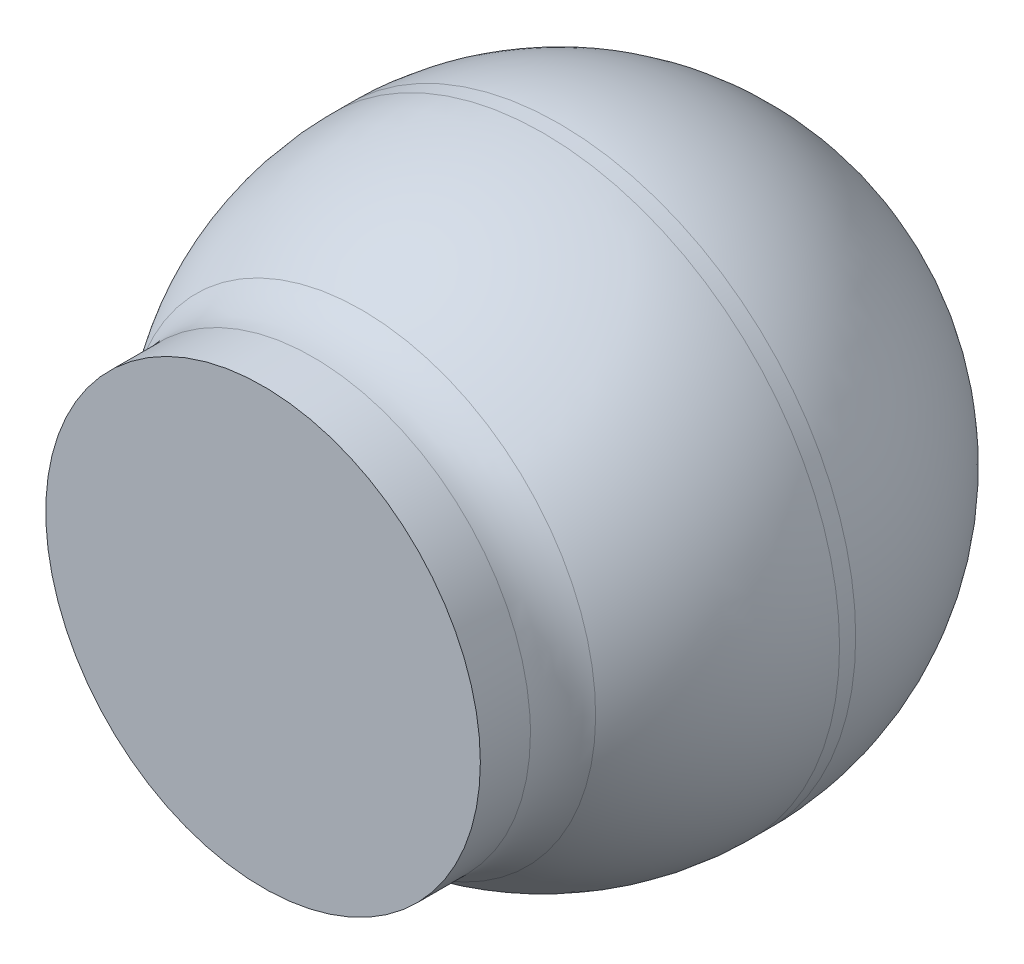
ISO-10303-21;
HEADER;
FILE_DESCRIPTION(('STEP AP214'),'2;1');
FILE_NAME('part.step','',(''),(''),'','','');
FILE_SCHEMA(('AUTOMOTIVE_DESIGN { 1 0 10303 214 1 1 1 1 }'));
ENDSEC;
DATA;
#1=APPLICATION_CONTEXT('core data for automotive mechanical design processes');
#2=APPLICATION_PROTOCOL_DEFINITION('international standard','automotive_design',2000,#1);
#3=PRODUCT_CONTEXT('',#1,'mechanical');
#4=PRODUCT('Part','Part','',(#3));
#5=PRODUCT_RELATED_PRODUCT_CATEGORY('part','',(#4));
#6=PRODUCT_DEFINITION_FORMATION('','',#4);
#7=PRODUCT_DEFINITION_CONTEXT('part definition',#1,'design');
#8=PRODUCT_DEFINITION('design','',#6,#7);
#9=PRODUCT_DEFINITION_SHAPE('','',#8);
#10=(LENGTH_UNIT() NAMED_UNIT(*) SI_UNIT(.MILLI.,.METRE.));
#11=(NAMED_UNIT(*) PLANE_ANGLE_UNIT() SI_UNIT($,.RADIAN.));
#12=(NAMED_UNIT(*) SI_UNIT($,.STERADIAN.) SOLID_ANGLE_UNIT());
#13=UNCERTAINTY_MEASURE_WITH_UNIT(LENGTH_MEASURE(1.E-05),#10,'distance_accuracy_value','');
#14=(GEOMETRIC_REPRESENTATION_CONTEXT(3) GLOBAL_UNCERTAINTY_ASSIGNED_CONTEXT((#13)) GLOBAL_UNIT_ASSIGNED_CONTEXT((#10,
#11,#12)) REPRESENTATION_CONTEXT('',''));
#15=CARTESIAN_POINT('',(0.,0.,0.));
#16=DIRECTION('',(0.,0.,1.));
#17=DIRECTION('',(1.,0.,0.));
#18=AXIS2_PLACEMENT_3D('',#15,#16,#17);
#19=CARTESIAN_POINT('',(-9.452919922269,-7.861349291452,10.006534503384));
#20=DIRECTION('',(0.,0.,-1.));
#21=DIRECTION('',(-1.,0.,0.));
#22=AXIS2_PLACEMENT_3D('',#19,#20,#21);
#23=PLANE('',#22);
#24=CARTESIAN_POINT('',(-9.452919922269,-7.861349291452,10.006534503384));
#25=DIRECTION('',(0.,0.,1.));
#26=DIRECTION('',(1.,0.,0.));
#27=AXIS2_PLACEMENT_3D('',#24,#25,#26);
#28=CIRCLE('',#27,0.275);
#29=CARTESIAN_POINT('',(-9.177919922269,-7.861349291452,10.006534503384));
#30=VERTEX_POINT('',#29);
#31=EDGE_CURVE('E20',#30,#30,#28,.F.);
#32=ORIENTED_EDGE('',*,*,#31,.F.);
#33=EDGE_LOOP('',(#32));
#34=FACE_BOUND('',#33,.T.);
#35=ADVANCED_FACE('F17',(#34),#23,.F.);
#36=CARTESIAN_POINT('',(-9.452919922269,-7.861349291452,9.906534503384));
#37=DIRECTION('',(0.,0.,1.));
#38=DIRECTION('',(1.,0.,0.));
#39=AXIS2_PLACEMENT_3D('',#36,#37,#38);
#40=CYLINDRICAL_SURFACE('',#39,0.275);
#41=CARTESIAN_POINT('',(-9.452919922269,-7.861349291452,9.943180457728));
#42=DIRECTION('',(0.,0.,-1.));
#43=DIRECTION('',(0.996700902337582,0.0811622527992467,0.));
#44=AXIS2_PLACEMENT_3D('',#41,#42,#43);
#45=CIRCLE('',#44,0.275000000000001);
#46=CARTESIAN_POINT('',(-9.17882717412617,-7.83902967193221,9.943180457728));
#47=VERTEX_POINT('',#46);
#48=EDGE_CURVE('E65',#47,#47,#45,.F.);
#49=ORIENTED_EDGE('',*,*,#48,.T.);
#50=EDGE_LOOP('',(#49));
#51=FACE_BOUND('',#50,.T.);
#52=ORIENTED_EDGE('',*,*,#31,.T.);
#53=EDGE_LOOP('',(#52));
#54=FACE_BOUND('',#53,.T.);
#55=ADVANCED_FACE('F62',(#51,#54),#40,.T.);
#56=CARTESIAN_POINT('',(-9.452919922269,-7.861349291452,9.943180457728));
#57=DIRECTION('',(0.,0.,-1.));
#58=DIRECTION('',(0.996700902337583,0.0811622527992448,0.));
#59=AXIS2_PLACEMENT_3D('',#56,#57,#58);
#60=TOROIDAL_SURFACE('',#59,0.375,0.1);
#61=ORIENTED_EDGE('',*,*,#48,.F.);
#62=EDGE_LOOP('',(#61));
#63=FACE_BOUND('',#62,.T.);
#64=CARTESIAN_POINT('',(-9.452919922269,-7.861349291452,9.881744931236));
#65=DIRECTION('',(0.,0.,-1.));
#66=DIRECTION('',(-0.996700902337597,-0.0811622527990627,0.));
#67=AXIS2_PLACEMENT_3D('',#64,#65,#66);
#68=CIRCLE('',#67,0.296097046412663);
#69=CARTESIAN_POINT('',(-9.748040115608,-7.885381194786,9.881744931236));
#70=VERTEX_POINT('',#69);
#71=EDGE_CURVE('E39',#70,#70,#68,.T.);
#72=ORIENTED_EDGE('',*,*,#71,.F.);
#73=EDGE_LOOP('',(#72));
#74=FACE_BOUND('',#73,.T.);
#75=ADVANCED_FACE('F57',(#63,#74),#60,.F.);
#76=CARTESIAN_POINT('',(-9.826682760645,-7.891785136252,9.651976062157));
#77=CARTESIAN_POINT('',(-9.826682760645,-7.891785136252,9.701461392103));
#78=CARTESIAN_POINT('',(-9.818526217348,-7.891120941579,9.750947004335));
#79=CARTESIAN_POINT('',(-9.802207085349,-7.889792059952,9.798626332798));
#80=CARTESIAN_POINT('',(-9.778341390838,-7.887848654938,9.842699544317));
#81=CARTESIAN_POINT('',(-9.748040115608,-7.885381194786,9.881744931236));
#82=(BOUNDED_CURVE() B_SPLINE_CURVE(5,(#76,#77,#78,#79,#80,#81),.UNSPECIFIED.,.F.,
.F.) B_SPLINE_CURVE_WITH_KNOTS((6,6),(0.,0.661568582165),
.UNSPECIFIED.) CURVE() GEOMETRIC_REPRESENTATION_ITEM() RATIONAL_B_SPLINE_CURVE((1.,1.,1.,1.,1.,1.)) REPRESENTATION_ITEM(''));
#83=CARTESIAN_POINT('',(-9.452919922269,-7.861349291452,9.651976062157));
#84=DIRECTION('',(0.,0.,-1.));
#85=AXIS1_PLACEMENT('',#83,#84);
#86=SURFACE_OF_REVOLUTION('',#82,#85);
#87=CARTESIAN_POINT('',(-9.452919922269,-7.861349291452,9.651976062157));
#88=DIRECTION('',(0.,0.,1.));
#89=DIRECTION('',(1.,0.,0.));
#90=AXIS2_PLACEMENT_3D('',#87,#88,#89);
#91=CIRCLE('',#90,0.375);
#92=CARTESIAN_POINT('',(-9.077919922269,-7.861349291452,9.651976062157));
#93=VERTEX_POINT('',#92);
#94=EDGE_CURVE('E36',#93,#93,#91,.F.);
#95=ORIENTED_EDGE('',*,*,#94,.F.);
#96=EDGE_LOOP('',(#95));
#97=FACE_BOUND('',#96,.T.);
#98=ORIENTED_EDGE('',*,*,#71,.T.);
#99=EDGE_LOOP('',(#98));
#100=FACE_BOUND('',#99,.T.);
#101=ADVANCED_FACE('F53',(#97,#100),#86,.F.);
#102=CARTESIAN_POINT('',(-9.452919922269,-7.861349291452,9.256534503384));
#103=DIRECTION('',(0.,0.,1.));
#104=DIRECTION('',(1.,0.,0.));
#105=AXIS2_PLACEMENT_3D('',#102,#103,#104);
#106=CYLINDRICAL_SURFACE('',#105,0.375);
#107=CARTESIAN_POINT('',(-9.452919922269,-7.861349291452,9.631534503384));
#108=DIRECTION('',(0.,0.,-1.));
#109=DIRECTION('',(0.0811622527992357,-0.996700902337583,0.));
#110=AXIS2_PLACEMENT_3D('',#107,#108,#109);
#111=CIRCLE('',#110,0.375);
#112=CARTESIAN_POINT('',(-9.42248407746929,-8.23511212982859,9.631534503384));
#113=VERTEX_POINT('',#112);
#114=CARTESIAN_POINT('',(-9.48335576706871,-7.48758645307541,9.631534503384));
#115=VERTEX_POINT('',#114);
#116=EDGE_CURVE('E11',#113,#115,#111,.T.);
#117=ORIENTED_EDGE('',*,*,#116,.F.);
#118=CARTESIAN_POINT('',(-9.45291992226901,-7.861349291452,9.631534503384));
#119=DIRECTION('',(0.,0.,1.));
#120=DIRECTION('',(0.0811622527992365,-0.996700902337583,0.));
#121=AXIS2_PLACEMENT_3D('',#118,#119,#120);
#122=CIRCLE('',#121,0.375);
#123=EDGE_CURVE('E25',#115,#113,#122,.F.);
#124=ORIENTED_EDGE('',*,*,#123,.F.);
#125=EDGE_LOOP('',(#117,#124));
#126=FACE_BOUND('',#125,.T.);
#127=ORIENTED_EDGE('',*,*,#94,.T.);
#128=EDGE_LOOP('',(#127));
#129=FACE_BOUND('',#128,.T.);
#130=ADVANCED_FACE('F34',(#126,#129),#106,.T.);
#131=CARTESIAN_POINT('',(-9.452919922269,-7.861349291452,9.631534503384));
#132=DIRECTION('',(0.0811622527992361,-0.996700902337583,0.));
#133=DIRECTION('',(-0.996700902337583,-0.0811622527992361,0.));
#134=AXIS2_PLACEMENT_3D('',#131,#132,#133);
#135=SPHERICAL_SURFACE('',#134,0.375);
#136=ORIENTED_EDGE('',*,*,#123,.T.);
#137=ORIENTED_EDGE('',*,*,#116,.T.);
#138=EDGE_LOOP('',(#136,#137));
#139=FACE_BOUND('',#138,.T.);
#140=ADVANCED_FACE('F32',(#139),#135,.T.);
#141=CLOSED_SHELL('',(#35,#55,#75,#101,#130,#140));
#142=MANIFOLD_SOLID_BREP('B1',#141);
#143=ADVANCED_BREP_SHAPE_REPRESENTATION('',(#18,#142),#14);
#144=SHAPE_DEFINITION_REPRESENTATION(#9,#143);
ENDSEC;
END-ISO-10303-21;
